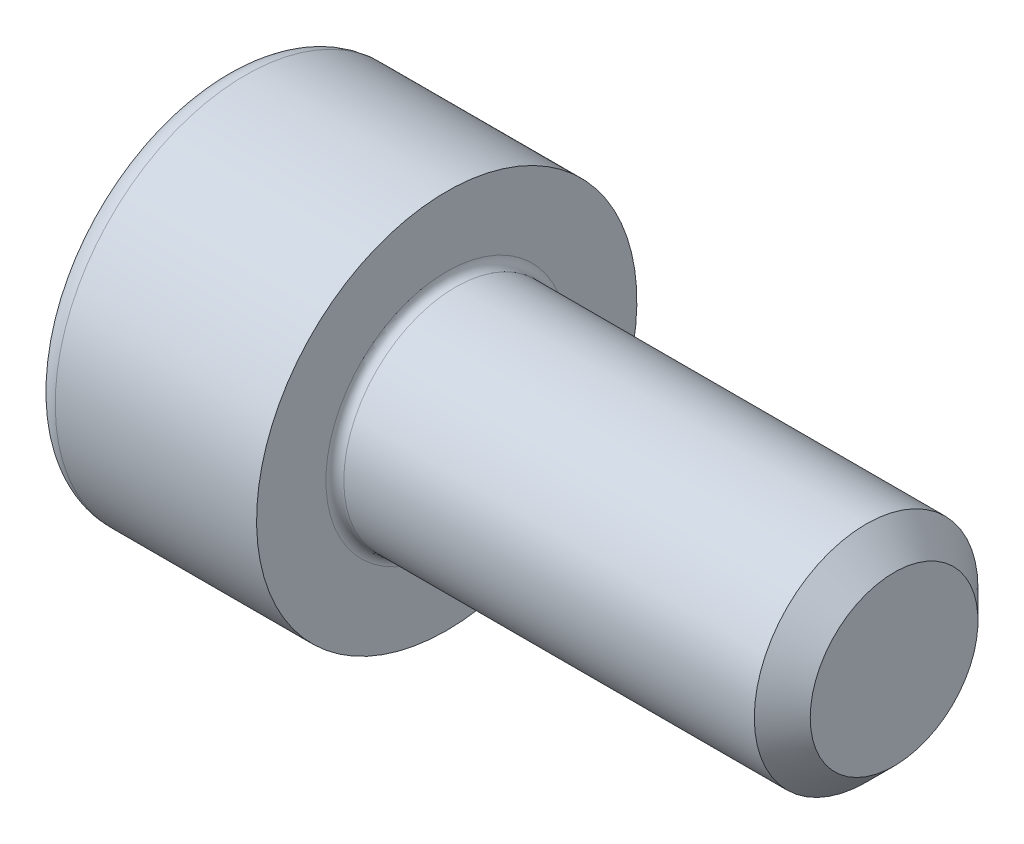
ISO-10303-21;
HEADER;
FILE_DESCRIPTION(('STEP AP214'),'2;1');
FILE_NAME('part.step','',(''),(''),'','','');
FILE_SCHEMA(('AUTOMOTIVE_DESIGN { 1 0 10303 214 1 1 1 1 }'));
ENDSEC;
DATA;
#1=APPLICATION_CONTEXT('core data for automotive mechanical design processes');
#2=APPLICATION_PROTOCOL_DEFINITION('international standard','automotive_design',2000,#1);
#3=PRODUCT_CONTEXT('',#1,'mechanical');
#4=PRODUCT('Part','Part','',(#3));
#5=PRODUCT_RELATED_PRODUCT_CATEGORY('part','',(#4));
#6=PRODUCT_DEFINITION_FORMATION('','',#4);
#7=PRODUCT_DEFINITION_CONTEXT('part definition',#1,'design');
#8=PRODUCT_DEFINITION('design','',#6,#7);
#9=PRODUCT_DEFINITION_SHAPE('','',#8);
#10=(LENGTH_UNIT() NAMED_UNIT(*) SI_UNIT(.MILLI.,.METRE.));
#11=(NAMED_UNIT(*) PLANE_ANGLE_UNIT() SI_UNIT($,.RADIAN.));
#12=(NAMED_UNIT(*) SI_UNIT($,.STERADIAN.) SOLID_ANGLE_UNIT());
#13=UNCERTAINTY_MEASURE_WITH_UNIT(LENGTH_MEASURE(1.E-05),#10,'distance_accuracy_value','');
#14=(GEOMETRIC_REPRESENTATION_CONTEXT(3) GLOBAL_UNCERTAINTY_ASSIGNED_CONTEXT((#13)) GLOBAL_UNIT_ASSIGNED_CONTEXT((#10,
#11,#12)) REPRESENTATION_CONTEXT('',''));
#15=CARTESIAN_POINT('',(0.,0.,0.));
#16=DIRECTION('',(0.,0.,1.));
#17=DIRECTION('',(1.,0.,0.));
#18=AXIS2_PLACEMENT_3D('',#15,#16,#17);
#19=CARTESIAN_POINT('',(-1.99999999995271,0.,0.));
#20=DIRECTION('',(-1.,0.,0.));
#21=DIRECTION('',(0.,0.,1.));
#22=AXIS2_PLACEMENT_3D('',#19,#20,#21);
#23=CONICAL_SURFACE('',#22,1.83319999985088,1.04719755109013);
#24=CARTESIAN_POINT('',(-0.941601486488253,-1.13686837721616E-10,0.));
#25=VERTEX_POINT('',#24);
#26=VERTEX_LOOP('',#25);
#27=FACE_BOUND('',#26,.T.);
#28=CARTESIAN_POINT('',(-2.00000000001834,0.,0.));
#29=DIRECTION('',(-1.,0.,0.));
#30=DIRECTION('',(0.,0.,1.));
#31=AXIS2_PLACEMENT_3D('',#28,#29,#30);
#32=CIRCLE('',#31,1.83319999996456);
#33=CARTESIAN_POINT('',(-2.00000000001834,-0.916599999982282,-1.58759777018694));
#34=VERTEX_POINT('',#33);
#35=CARTESIAN_POINT('',(-2.00000000001834,-1.83319999996456,0.));
#36=VERTEX_POINT('',#35);
#37=EDGE_CURVE('E89',#34,#36,#32,.T.);
#38=ORIENTED_EDGE('',*,*,#37,.T.);
#39=CARTESIAN_POINT('',(-2.00000000001834,0.,0.));
#40=DIRECTION('',(-1.,0.,0.));
#41=DIRECTION('',(0.,0.,1.));
#42=AXIS2_PLACEMENT_3D('',#39,#40,#41);
#43=CIRCLE('',#42,1.83319999996456);
#44=CARTESIAN_POINT('',(-2.00000000001834,-0.916599999982281,1.58759777018694));
#45=VERTEX_POINT('',#44);
#46=EDGE_CURVE('E84',#36,#45,#43,.T.);
#47=ORIENTED_EDGE('',*,*,#46,.T.);
#48=CARTESIAN_POINT('',(-2.00000000001834,0.,0.));
#49=DIRECTION('',(-1.,0.,0.));
#50=DIRECTION('',(0.,0.,1.));
#51=AXIS2_PLACEMENT_3D('',#48,#49,#50);
#52=CIRCLE('',#51,1.83319999996456);
#53=CARTESIAN_POINT('',(-1.99999999995271,0.916599999925436,1.58759777008849));
#54=VERTEX_POINT('',#53);
#55=EDGE_CURVE('E86',#45,#54,#52,.T.);
#56=ORIENTED_EDGE('',*,*,#55,.T.);
#57=CARTESIAN_POINT('',(-1.99999999995271,0.,0.));
#58=DIRECTION('',(-1.,0.,0.));
#59=DIRECTION('',(0.,0.,1.));
#60=AXIS2_PLACEMENT_3D('',#57,#58,#59);
#61=CIRCLE('',#60,1.83319999985088);
#62=CARTESIAN_POINT('',(-1.99999999995271,1.83319999985088,0.));
#63=VERTEX_POINT('',#62);
#64=EDGE_CURVE('E100',#54,#63,#61,.T.);
#65=ORIENTED_EDGE('',*,*,#64,.T.);
#66=CARTESIAN_POINT('',(-2.00000000001834,0.,0.));
#67=DIRECTION('',(-1.,0.,0.));
#68=DIRECTION('',(0.,0.,1.));
#69=AXIS2_PLACEMENT_3D('',#66,#67,#68);
#70=CIRCLE('',#69,1.83319999996456);
#71=CARTESIAN_POINT('',(-2.00000000001834,0.91659999998228,-1.58759777018694));
#72=VERTEX_POINT('',#71);
#73=EDGE_CURVE('E187',#63,#72,#70,.T.);
#74=ORIENTED_EDGE('',*,*,#73,.T.);
#75=CARTESIAN_POINT('',(-2.00000000001834,0.,0.));
#76=DIRECTION('',(-1.,0.,0.));
#77=DIRECTION('',(0.,0.,1.));
#78=AXIS2_PLACEMENT_3D('',#75,#76,#77);
#79=CIRCLE('',#78,1.83319999996456);
#80=EDGE_CURVE('E185',#72,#34,#79,.T.);
#81=ORIENTED_EDGE('',*,*,#80,.T.);
#82=EDGE_LOOP('',(#38,#47,#56,#65,#74,#81));
#83=FACE_BOUND('',#82,.T.);
#84=ADVANCED_FACE('F17',(#27,#83),#23,.F.);
#85=CARTESIAN_POINT('',(-2.,0.,0.));
#86=DIRECTION('',(-1.,0.,0.));
#87=DIRECTION('',(0.,-1.,0.));
#88=AXIS2_PLACEMENT_3D('',#85,#86,#87);
#89=PLANE('',#88);
#90=ORIENTED_EDGE('',*,*,#55,.F.);
#91=DIRECTION('',(0.,-1.,0.));
#92=VECTOR('',#91,1.);
#93=CARTESIAN_POINT('',(-2.,-0.9166,1.58759777021763));
#94=LINE('',#93,#92);
#95=EDGE_CURVE('E94',#45,#54,#94,.F.);
#96=ORIENTED_EDGE('',*,*,#95,.T.);
#97=EDGE_LOOP('',(#90,#96));
#98=FACE_BOUND('',#97,.T.);
#99=ADVANCED_FACE('F97',(#98),#89,.F.);
#100=CARTESIAN_POINT('',(-2.,0.,0.));
#101=DIRECTION('',(-1.,0.,0.));
#102=DIRECTION('',(0.,-1.,0.));
#103=AXIS2_PLACEMENT_3D('',#100,#101,#102);
#104=PLANE('',#103);
#105=ORIENTED_EDGE('',*,*,#64,.F.);
#106=DIRECTION('',(0.,-0.5,0.866025403784439));
#107=VECTOR('',#106,1.);
#108=CARTESIAN_POINT('',(-2.,0.9166,1.58759777021763));
#109=LINE('',#108,#107);
#110=EDGE_CURVE('E163',#54,#63,#109,.F.);
#111=ORIENTED_EDGE('',*,*,#110,.T.);
#112=EDGE_LOOP('',(#105,#111));
#113=FACE_BOUND('',#112,.T.);
#114=ADVANCED_FACE('F294',(#113),#104,.F.);
#115=CARTESIAN_POINT('',(-2.,0.,0.));
#116=DIRECTION('',(-1.,0.,0.));
#117=DIRECTION('',(0.,-1.,0.));
#118=AXIS2_PLACEMENT_3D('',#115,#116,#117);
#119=PLANE('',#118);
#120=ORIENTED_EDGE('',*,*,#73,.F.);
#121=DIRECTION('',(0.,0.5,0.866025403784439));
#122=VECTOR('',#121,1.);
#123=CARTESIAN_POINT('',(-2.,1.8332,0.));
#124=LINE('',#123,#122);
#125=EDGE_CURVE('E152',#63,#72,#124,.F.);
#126=ORIENTED_EDGE('',*,*,#125,.T.);
#127=EDGE_LOOP('',(#120,#126));
#128=FACE_BOUND('',#127,.T.);
#129=ADVANCED_FACE('F298',(#128),#119,.F.);
#130=CARTESIAN_POINT('',(-2.,0.,0.));
#131=DIRECTION('',(-1.,0.,0.));
#132=DIRECTION('',(0.,-1.,0.));
#133=AXIS2_PLACEMENT_3D('',#130,#131,#132);
#134=PLANE('',#133);
#135=ORIENTED_EDGE('',*,*,#80,.F.);
#136=DIRECTION('',(0.,1.,0.));
#137=VECTOR('',#136,1.);
#138=CARTESIAN_POINT('',(-2.,0.9166,-1.58759777021763));
#139=LINE('',#138,#137);
#140=EDGE_CURVE('E140',#72,#34,#139,.F.);
#141=ORIENTED_EDGE('',*,*,#140,.T.);
#142=EDGE_LOOP('',(#135,#141));
#143=FACE_BOUND('',#142,.T.);
#144=ADVANCED_FACE('F305',(#143),#134,.F.);
#145=CARTESIAN_POINT('',(-2.,0.,0.));
#146=DIRECTION('',(-1.,0.,0.));
#147=DIRECTION('',(0.,-1.,0.));
#148=AXIS2_PLACEMENT_3D('',#145,#146,#147);
#149=PLANE('',#148);
#150=ORIENTED_EDGE('',*,*,#37,.F.);
#151=DIRECTION('',(0.,0.5,-0.866025403784438));
#152=VECTOR('',#151,1.);
#153=CARTESIAN_POINT('',(-2.,-0.9166,-1.58759777021763));
#154=LINE('',#153,#152);
#155=EDGE_CURVE('E126',#34,#36,#154,.F.);
#156=ORIENTED_EDGE('',*,*,#155,.T.);
#157=EDGE_LOOP('',(#150,#156));
#158=FACE_BOUND('',#157,.T.);
#159=ADVANCED_FACE('F308',(#158),#149,.F.);
#160=CARTESIAN_POINT('',(-2.,0.,0.));
#161=DIRECTION('',(-1.,0.,0.));
#162=DIRECTION('',(0.,-1.,0.));
#163=AXIS2_PLACEMENT_3D('',#160,#161,#162);
#164=PLANE('',#163);
#165=ORIENTED_EDGE('',*,*,#46,.F.);
#166=DIRECTION('',(0.,-0.5,-0.866025403784438));
#167=VECTOR('',#166,1.);
#168=CARTESIAN_POINT('',(-2.,-1.8332,0.));
#169=LINE('',#168,#167);
#170=EDGE_CURVE('E102',#36,#45,#169,.F.);
#171=ORIENTED_EDGE('',*,*,#170,.T.);
#172=EDGE_LOOP('',(#165,#171));
#173=FACE_BOUND('',#172,.T.);
#174=ADVANCED_FACE('F103',(#173),#164,.F.);
#175=CARTESIAN_POINT('',(-2.,-0.9166,1.58759777021763));
#176=DIRECTION('',(0.,0.,1.));
#177=DIRECTION('',(0.,-1.,0.));
#178=AXIS2_PLACEMENT_3D('',#175,#176,#177);
#179=PLANE('',#178);
#180=DIRECTION('',(1.,0.,0.));
#181=VECTOR('',#180,1.);
#182=CARTESIAN_POINT('',(-2.,0.9166,1.58759777021763));
#183=LINE('',#182,#181);
#184=CARTESIAN_POINT('',(-4.,0.916599999999999,1.58759777021763));
#185=VERTEX_POINT('',#184);
#186=EDGE_CURVE('E114',#185,#54,#183,.T.);
#187=ORIENTED_EDGE('',*,*,#186,.T.);
#188=ORIENTED_EDGE('',*,*,#95,.F.);
#189=DIRECTION('',(1.,0.,0.));
#190=VECTOR('',#189,1.);
#191=CARTESIAN_POINT('',(-2.,-0.9166,1.58759777021763));
#192=LINE('',#191,#190);
#193=CARTESIAN_POINT('',(-4.,-0.9166,1.58759777021763));
#194=VERTEX_POINT('',#193);
#195=EDGE_CURVE('E107',#45,#194,#192,.F.);
#196=ORIENTED_EDGE('',*,*,#195,.T.);
#197=DIRECTION('',(0.,1.,0.));
#198=VECTOR('',#197,1.);
#199=CARTESIAN_POINT('',(-4.,1.8332,1.58759777021763));
#200=LINE('',#199,#198);
#201=EDGE_CURVE('E121',#194,#185,#200,.T.);
#202=ORIENTED_EDGE('',*,*,#201,.T.);
#203=EDGE_LOOP('',(#187,#188,#196,#202));
#204=FACE_BOUND('',#203,.T.);
#205=ADVANCED_FACE('F111',(#204),#179,.F.);
#206=CARTESIAN_POINT('',(-2.,0.9166,1.58759777021763));
#207=DIRECTION('',(0.,0.866025403784439,0.5));
#208=DIRECTION('',(0.,-0.5,0.866025403784439));
#209=AXIS2_PLACEMENT_3D('',#206,#207,#208);
#210=PLANE('',#209);
#211=DIRECTION('',(1.,0.,0.));
#212=VECTOR('',#211,1.);
#213=CARTESIAN_POINT('',(-2.,1.8332,0.));
#214=LINE('',#213,#212);
#215=CARTESIAN_POINT('',(-4.,1.8332,0.));
#216=VERTEX_POINT('',#215);
#217=EDGE_CURVE('E157',#216,#63,#214,.T.);
#218=ORIENTED_EDGE('',*,*,#217,.T.);
#219=ORIENTED_EDGE('',*,*,#110,.F.);
#220=ORIENTED_EDGE('',*,*,#186,.F.);
#221=DIRECTION('',(0.,0.500000000000001,-0.866025403784438));
#222=VECTOR('',#221,1.);
#223=CARTESIAN_POINT('',(-4.,0.9166,1.58759777021763));
#224=LINE('',#223,#222);
#225=EDGE_CURVE('E123',#185,#216,#224,.T.);
#226=ORIENTED_EDGE('',*,*,#225,.T.);
#227=EDGE_LOOP('',(#218,#219,#220,#226));
#228=FACE_BOUND('',#227,.T.);
#229=ADVANCED_FACE('F290',(#228),#210,.F.);
#230=CARTESIAN_POINT('',(-2.,1.8332,0.));
#231=DIRECTION('',(0.,0.866025403784439,-0.5));
#232=DIRECTION('',(0.,0.5,0.866025403784439));
#233=AXIS2_PLACEMENT_3D('',#230,#231,#232);
#234=PLANE('',#233);
#235=DIRECTION('',(1.,0.,0.));
#236=VECTOR('',#235,1.);
#237=CARTESIAN_POINT('',(-2.,0.9166,-1.58759777021763));
#238=LINE('',#237,#236);
#239=CARTESIAN_POINT('',(-4.,0.9166,-1.58759777021763));
#240=VERTEX_POINT('',#239);
#241=EDGE_CURVE('E145',#240,#72,#238,.T.);
#242=ORIENTED_EDGE('',*,*,#241,.T.);
#243=ORIENTED_EDGE('',*,*,#125,.F.);
#244=ORIENTED_EDGE('',*,*,#217,.F.);
#245=DIRECTION('',(0.,-0.499999999999999,-0.866025403784439));
#246=VECTOR('',#245,1.);
#247=CARTESIAN_POINT('',(-4.,1.8332,0.));
#248=LINE('',#247,#246);
#249=EDGE_CURVE('E147',#216,#240,#248,.T.);
#250=ORIENTED_EDGE('',*,*,#249,.T.);
#251=EDGE_LOOP('',(#242,#243,#244,#250));
#252=FACE_BOUND('',#251,.T.);
#253=ADVANCED_FACE('F301',(#252),#234,.F.);
#254=CARTESIAN_POINT('',(-2.,0.9166,-1.58759777021763));
#255=DIRECTION('',(0.,0.,-1.));
#256=DIRECTION('',(0.,1.,0.));
#257=AXIS2_PLACEMENT_3D('',#254,#255,#256);
#258=PLANE('',#257);
#259=DIRECTION('',(1.,0.,0.));
#260=VECTOR('',#259,1.);
#261=CARTESIAN_POINT('',(-2.,-0.9166,-1.58759777021763));
#262=LINE('',#261,#260);
#263=CARTESIAN_POINT('',(-4.,-0.9166,-1.58759777021763));
#264=VERTEX_POINT('',#263);
#265=EDGE_CURVE('E128',#264,#34,#262,.T.);
#266=ORIENTED_EDGE('',*,*,#265,.T.);
#267=ORIENTED_EDGE('',*,*,#140,.F.);
#268=ORIENTED_EDGE('',*,*,#241,.F.);
#269=DIRECTION('',(0.,1.,0.));
#270=VECTOR('',#269,1.);
#271=CARTESIAN_POINT('',(-4.,1.8332,-1.58759777021763));
#272=LINE('',#271,#270);
#273=EDGE_CURVE('E131',#240,#264,#272,.F.);
#274=ORIENTED_EDGE('',*,*,#273,.T.);
#275=EDGE_LOOP('',(#266,#267,#268,#274));
#276=FACE_BOUND('',#275,.T.);
#277=ADVANCED_FACE('F306',(#276),#258,.F.);
#278=CARTESIAN_POINT('',(-2.,-0.9166,-1.58759777021763));
#279=DIRECTION('',(0.,-0.866025403784438,-0.5));
#280=DIRECTION('',(0.,0.5,-0.866025403784438));
#281=AXIS2_PLACEMENT_3D('',#278,#279,#280);
#282=PLANE('',#281);
#283=DIRECTION('',(1.,0.,0.));
#284=VECTOR('',#283,1.);
#285=CARTESIAN_POINT('',(-2.,-1.8332,0.));
#286=LINE('',#285,#284);
#287=CARTESIAN_POINT('',(-4.,-1.8332,0.));
#288=VERTEX_POINT('',#287);
#289=EDGE_CURVE('E108',#288,#36,#286,.T.);
#290=ORIENTED_EDGE('',*,*,#289,.T.);
#291=ORIENTED_EDGE('',*,*,#155,.F.);
#292=ORIENTED_EDGE('',*,*,#265,.F.);
#293=DIRECTION('',(0.,-0.5,0.866025403784439));
#294=VECTOR('',#293,1.);
#295=CARTESIAN_POINT('',(-4.,-0.9166,-1.58759777021763));
#296=LINE('',#295,#294);
#297=EDGE_CURVE('E129',#264,#288,#296,.T.);
#298=ORIENTED_EDGE('',*,*,#297,.T.);
#299=EDGE_LOOP('',(#290,#291,#292,#298));
#300=FACE_BOUND('',#299,.T.);
#301=ADVANCED_FACE('F281',(#300),#282,.F.);
#302=CARTESIAN_POINT('',(-2.,-1.8332,0.));
#303=DIRECTION('',(0.,-0.866025403784438,0.5));
#304=DIRECTION('',(0.,-0.5,-0.866025403784438));
#305=AXIS2_PLACEMENT_3D('',#302,#303,#304);
#306=PLANE('',#305);
#307=ORIENTED_EDGE('',*,*,#195,.F.);
#308=ORIENTED_EDGE('',*,*,#170,.F.);
#309=ORIENTED_EDGE('',*,*,#289,.F.);
#310=DIRECTION('',(0.,0.5,0.866025403784439));
#311=VECTOR('',#310,1.);
#312=CARTESIAN_POINT('',(-4.,-1.8332,0.));
#313=LINE('',#312,#311);
#314=EDGE_CURVE('E119',#288,#194,#313,.T.);
#315=ORIENTED_EDGE('',*,*,#314,.T.);
#316=EDGE_LOOP('',(#307,#308,#309,#315));
#317=FACE_BOUND('',#316,.T.);
#318=ADVANCED_FACE('F117',(#317),#306,.F.);
#319=CARTESIAN_POINT('',(-4.,1.8332,0.));
#320=DIRECTION('',(1.,0.,0.));
#321=DIRECTION('',(0.,1.,0.));
#322=AXIS2_PLACEMENT_3D('',#319,#320,#321);
#323=PLANE('',#322);
#324=CARTESIAN_POINT('',(-4.,0.,0.));
#325=DIRECTION('',(1.,0.,0.));
#326=DIRECTION('',(0.,-1.,0.));
#327=AXIS2_PLACEMENT_3D('',#324,#325,#326);
#328=CIRCLE('',#327,3.);
#329=CARTESIAN_POINT('',(-4.,-3.,0.));
#330=VERTEX_POINT('',#329);
#331=CARTESIAN_POINT('',(-4.,3.,0.));
#332=VERTEX_POINT('',#331);
#333=EDGE_CURVE('E135',#330,#332,#328,.T.);
#334=ORIENTED_EDGE('',*,*,#333,.F.);
#335=CARTESIAN_POINT('',(-4.,0.,0.));
#336=DIRECTION('',(1.,0.,0.));
#337=DIRECTION('',(0.,1.,0.));
#338=AXIS2_PLACEMENT_3D('',#335,#336,#337);
#339=CIRCLE('',#338,3.);
#340=EDGE_CURVE('E250',#332,#330,#339,.T.);
#341=ORIENTED_EDGE('',*,*,#340,.F.);
#342=EDGE_LOOP('',(#334,#341));
#343=FACE_BOUND('',#342,.T.);
#344=ORIENTED_EDGE('',*,*,#297,.F.);
#345=ORIENTED_EDGE('',*,*,#273,.F.);
#346=ORIENTED_EDGE('',*,*,#249,.F.);
#347=ORIENTED_EDGE('',*,*,#225,.F.);
#348=ORIENTED_EDGE('',*,*,#201,.F.);
#349=ORIENTED_EDGE('',*,*,#314,.F.);
#350=EDGE_LOOP('',(#344,#345,#346,#347,#348,#349));
#351=FACE_BOUND('',#350,.T.);
#352=ADVANCED_FACE('F259',(#343,#351),#323,.F.);
#353=CARTESIAN_POINT('',(-3.6,0.,0.));
#354=DIRECTION('',(-1.,0.,0.));
#355=DIRECTION('',(0.,1.,0.));
#356=AXIS2_PLACEMENT_3D('',#353,#354,#355);
#357=TOROIDAL_SURFACE('',#356,3.,0.4);
#358=ORIENTED_EDGE('',*,*,#333,.T.);
#359=ORIENTED_EDGE('',*,*,#340,.T.);
#360=EDGE_LOOP('',(#358,#359));
#361=FACE_BOUND('',#360,.T.);
#362=CARTESIAN_POINT('',(-3.6,0.,0.));
#363=DIRECTION('',(-1.,0.,0.));
#364=DIRECTION('',(0.,-1.,0.));
#365=AXIS2_PLACEMENT_3D('',#362,#363,#364);
#366=CIRCLE('',#365,3.4);
#367=CARTESIAN_POINT('',(-3.6,-3.4,0.));
#368=VERTEX_POINT('',#367);
#369=EDGE_CURVE('E182',#368,#368,#366,.F.);
#370=ORIENTED_EDGE('',*,*,#369,.F.);
#371=EDGE_LOOP('',(#370));
#372=FACE_BOUND('',#371,.T.);
#373=ADVANCED_FACE('F254',(#361,#372),#357,.T.);
#374=CARTESIAN_POINT('',(-0.94160148652158,0.,0.));
#375=DIRECTION('',(-1.,0.,0.));
#376=DIRECTION('',(0.,-1.,0.));
#377=AXIS2_PLACEMENT_3D('',#374,#375,#376);
#378=CYLINDRICAL_SURFACE('',#377,3.4);
#379=ORIENTED_EDGE('',*,*,#369,.T.);
#380=EDGE_LOOP('',(#379));
#381=FACE_BOUND('',#380,.T.);
#382=CARTESIAN_POINT('',(0.,0.,0.));
#383=DIRECTION('',(-1.,0.,0.));
#384=DIRECTION('',(0.,-1.,0.));
#385=AXIS2_PLACEMENT_3D('',#382,#383,#384);
#386=CIRCLE('',#385,3.4);
#387=CARTESIAN_POINT('',(0.,-3.4,0.));
#388=VERTEX_POINT('',#387);
#389=EDGE_CURVE('E180',#388,#388,#386,.T.);
#390=ORIENTED_EDGE('',*,*,#389,.T.);
#391=EDGE_LOOP('',(#390));
#392=FACE_BOUND('',#391,.T.);
#393=ADVANCED_FACE('F258',(#381,#392),#378,.T.);
#394=CARTESIAN_POINT('',(8.,0.,0.));
#395=DIRECTION('',(-1.,0.,0.));
#396=DIRECTION('',(0.,0.,1.));
#397=AXIS2_PLACEMENT_3D('',#394,#395,#396);
#398=PLANE('',#397);
#399=CARTESIAN_POINT('',(8.0000000000382,0.,0.));
#400=DIRECTION('',(-1.,0.,0.));
#401=DIRECTION('',(0.,0.,1.));
#402=AXIS2_PLACEMENT_3D('',#399,#400,#401);
#403=CIRCLE('',#402,1.49999999990769);
#404=CARTESIAN_POINT('',(8.0000000000382,0.,1.49999999990769));
#405=VERTEX_POINT('',#404);
#406=EDGE_CURVE('E176',#405,#405,#403,.T.);
#407=ORIENTED_EDGE('',*,*,#406,.F.);
#408=EDGE_LOOP('',(#407));
#409=FACE_BOUND('',#408,.T.);
#410=ADVANCED_FACE('F227',(#409),#398,.F.);
#411=CARTESIAN_POINT('',(0.,3.4,0.));
#412=DIRECTION('',(-1.,0.,0.));
#413=DIRECTION('',(0.,-1.,0.));
#414=AXIS2_PLACEMENT_3D('',#411,#412,#413);
#415=PLANE('',#414);
#416=CARTESIAN_POINT('',(0.,0.,0.));
#417=DIRECTION('',(1.,0.,0.));
#418=DIRECTION('',(0.,-1.,0.));
#419=AXIS2_PLACEMENT_3D('',#416,#417,#418);
#420=CIRCLE('',#419,2.16);
#421=CARTESIAN_POINT('',(0.,2.16,0.));
#422=VERTEX_POINT('',#421);
#423=CARTESIAN_POINT('',(0.,-2.16,0.));
#424=VERTEX_POINT('',#423);
#425=EDGE_CURVE('E179',#422,#424,#420,.F.);
#426=ORIENTED_EDGE('',*,*,#425,.T.);
#427=CARTESIAN_POINT('',(0.,0.,0.));
#428=DIRECTION('',(1.,0.,0.));
#429=DIRECTION('',(0.,1.,0.));
#430=AXIS2_PLACEMENT_3D('',#427,#428,#429);
#431=CIRCLE('',#430,2.16);
#432=EDGE_CURVE('E36',#424,#422,#431,.F.);
#433=ORIENTED_EDGE('',*,*,#432,.T.);
#434=EDGE_LOOP('',(#426,#433));
#435=FACE_BOUND('',#434,.T.);
#436=ORIENTED_EDGE('',*,*,#389,.F.);
#437=EDGE_LOOP('',(#436));
#438=FACE_BOUND('',#437,.T.);
#439=ADVANCED_FACE('F218',(#435,#438),#415,.F.);
#440=CARTESIAN_POINT('',(7.49999999999318,0.,0.));
#441=DIRECTION('',(-1.,0.,0.));
#442=DIRECTION('',(0.,0.,1.));
#443=AXIS2_PLACEMENT_3D('',#440,#441,#442);
#444=CONICAL_SURFACE('',#443,1.99999999995271,0.785398163397448);
#445=ORIENTED_EDGE('',*,*,#406,.T.);
#446=EDGE_LOOP('',(#445));
#447=FACE_BOUND('',#446,.T.);
#448=CARTESIAN_POINT('',(7.5,0.,0.));
#449=DIRECTION('',(-1.,0.,0.));
#450=DIRECTION('',(0.,-1.,0.));
#451=AXIS2_PLACEMENT_3D('',#448,#449,#450);
#452=CIRCLE('',#451,2.);
#453=CARTESIAN_POINT('',(7.5,-2.,0.));
#454=VERTEX_POINT('',#453);
#455=EDGE_CURVE('E28',#454,#454,#452,.T.);
#456=ORIENTED_EDGE('',*,*,#455,.F.);
#457=EDGE_LOOP('',(#456));
#458=FACE_BOUND('',#457,.T.);
#459=ADVANCED_FACE('F207',(#447,#458),#444,.T.);
#460=CARTESIAN_POINT('',(0.16,0.,0.));
#461=DIRECTION('',(-1.,0.,0.));
#462=DIRECTION('',(0.,1.,0.));
#463=AXIS2_PLACEMENT_3D('',#460,#461,#462);
#464=TOROIDAL_SURFACE('',#463,2.16,0.16);
#465=CARTESIAN_POINT('',(0.16,0.,0.));
#466=DIRECTION('',(-1.,0.,0.));
#467=DIRECTION('',(0.,-1.,0.));
#468=AXIS2_PLACEMENT_3D('',#465,#466,#467);
#469=CIRCLE('',#468,2.);
#470=CARTESIAN_POINT('',(0.16,-2.,0.));
#471=VERTEX_POINT('',#470);
#472=EDGE_CURVE('E11',#471,#471,#469,.F.);
#473=ORIENTED_EDGE('',*,*,#472,.F.);
#474=EDGE_LOOP('',(#473));
#475=FACE_BOUND('',#474,.T.);
#476=ORIENTED_EDGE('',*,*,#425,.F.);
#477=ORIENTED_EDGE('',*,*,#432,.F.);
#478=EDGE_LOOP('',(#476,#477));
#479=FACE_BOUND('',#478,.T.);
#480=ADVANCED_FACE('F195',(#475,#479),#464,.F.);
#481=CARTESIAN_POINT('',(-0.94160148652158,0.,0.));
#482=DIRECTION('',(-1.,0.,0.));
#483=DIRECTION('',(0.,-1.,0.));
#484=AXIS2_PLACEMENT_3D('',#481,#482,#483);
#485=CYLINDRICAL_SURFACE('',#484,2.);
#486=ORIENTED_EDGE('',*,*,#472,.T.);
#487=EDGE_LOOP('',(#486));
#488=FACE_BOUND('',#487,.T.);
#489=ORIENTED_EDGE('',*,*,#455,.T.);
#490=EDGE_LOOP('',(#489));
#491=FACE_BOUND('',#490,.T.);
#492=ADVANCED_FACE('F206',(#488,#491),#485,.T.);
#493=CLOSED_SHELL('',(#84,#99,#114,#129,#144,#159,#174,#205,#229,#253,#277,#301,#318,#352,#373,
#393,#410,#439,#459,#480,#492));
#494=MANIFOLD_SOLID_BREP('B1',#493);
#495=ADVANCED_BREP_SHAPE_REPRESENTATION('',(#18,#494),#14);
#496=SHAPE_DEFINITION_REPRESENTATION(#9,#495);
ENDSEC;
END-ISO-10303-21;
